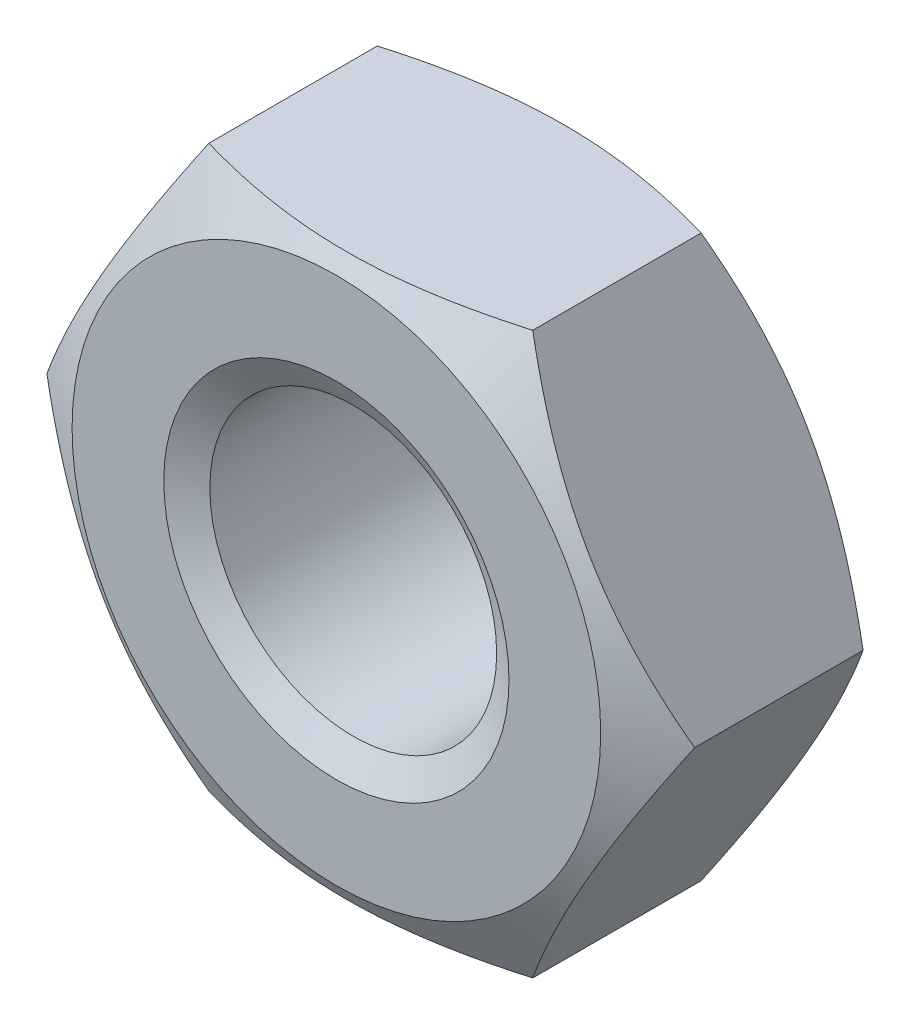
ISO-10303-21;
HEADER;
FILE_DESCRIPTION(('STEP AP214'),'2;1');
FILE_NAME('part.step','',(''),(''),'','','');
FILE_SCHEMA(('AUTOMOTIVE_DESIGN { 1 0 10303 214 1 1 1 1 }'));
ENDSEC;
DATA;
#1=APPLICATION_CONTEXT('core data for automotive mechanical design processes');
#2=APPLICATION_PROTOCOL_DEFINITION('international standard','automotive_design',2000,#1);
#3=PRODUCT_CONTEXT('',#1,'mechanical');
#4=PRODUCT('Part','Part','',(#3));
#5=PRODUCT_RELATED_PRODUCT_CATEGORY('part','',(#4));
#6=PRODUCT_DEFINITION_FORMATION('','',#4);
#7=PRODUCT_DEFINITION_CONTEXT('part definition',#1,'design');
#8=PRODUCT_DEFINITION('design','',#6,#7);
#9=PRODUCT_DEFINITION_SHAPE('','',#8);
#10=(LENGTH_UNIT() NAMED_UNIT(*) SI_UNIT(.MILLI.,.METRE.));
#11=(NAMED_UNIT(*) PLANE_ANGLE_UNIT() SI_UNIT($,.RADIAN.));
#12=(NAMED_UNIT(*) SI_UNIT($,.STERADIAN.) SOLID_ANGLE_UNIT());
#13=UNCERTAINTY_MEASURE_WITH_UNIT(LENGTH_MEASURE(1.E-05),#10,'distance_accuracy_value','');
#14=(GEOMETRIC_REPRESENTATION_CONTEXT(3) GLOBAL_UNCERTAINTY_ASSIGNED_CONTEXT((#13)) GLOBAL_UNIT_ASSIGNED_CONTEXT((#10,
#11,#12)) REPRESENTATION_CONTEXT('',''));
#15=CARTESIAN_POINT('',(0.,0.,0.));
#16=DIRECTION('',(0.,0.,1.));
#17=DIRECTION('',(1.,0.,0.));
#18=AXIS2_PLACEMENT_3D('',#15,#16,#17);
#19=CARTESIAN_POINT('',(0.,-13.,0.));
#20=DIRECTION('',(0.,0.,-1.));
#21=DIRECTION('',(-1.,0.,0.));
#22=AXIS2_PLACEMENT_3D('',#19,#20,#21);
#23=PLANE('',#22);
#24=CARTESIAN_POINT('',(0.,0.,0.));
#25=DIRECTION('',(0.,0.,-1.));
#26=DIRECTION('',(-1.,0.,0.));
#27=AXIS2_PLACEMENT_3D('',#24,#25,#26);
#28=CIRCLE('',#27,6.12499999994043);
#29=CARTESIAN_POINT('',(-6.12499999994043,0.,0.));
#30=VERTEX_POINT('',#29);
#31=EDGE_CURVE('E105',#30,#30,#28,.T.);
#32=ORIENTED_EDGE('',*,*,#31,.F.);
#33=EDGE_LOOP('',(#32));
#34=FACE_BOUND('',#33,.T.);
#35=CARTESIAN_POINT('',(0.,0.,0.));
#36=DIRECTION('',(0.,0.,1.));
#37=DIRECTION('',(1.,0.,0.));
#38=AXIS2_PLACEMENT_3D('',#35,#36,#37);
#39=CIRCLE('',#38,4.0000000000191);
#40=CARTESIAN_POINT('',(4.0000000000191,0.,0.));
#41=VERTEX_POINT('',#40);
#42=EDGE_CURVE('E20',#41,#41,#39,.F.);
#43=ORIENTED_EDGE('',*,*,#42,.T.);
#44=EDGE_LOOP('',(#43));
#45=FACE_BOUND('',#44,.T.);
#46=ADVANCED_FACE('F17',(#34,#45),#23,.F.);
#47=CARTESIAN_POINT('',(0.,0.,0.));
#48=DIRECTION('',(0.,0.,1.));
#49=DIRECTION('',(1.,0.,0.));
#50=AXIS2_PLACEMENT_3D('',#47,#48,#49);
#51=CONICAL_SURFACE('',#50,4.0000000000191,1.04719755120605);
#52=ORIENTED_EDGE('',*,*,#42,.F.);
#53=EDGE_LOOP('',(#52));
#54=FACE_BOUND('',#53,.T.);
#55=CARTESIAN_POINT('',(0.,0.,-0.39057745710678));
#56=DIRECTION('',(0.,0.,1.));
#57=DIRECTION('',(1.,0.,0.));
#58=AXIS2_PLACEMENT_3D('',#55,#56,#57);
#59=CIRCLE('',#58,3.3235);
#60=CARTESIAN_POINT('',(3.3235,0.,-0.39057745710678));
#61=VERTEX_POINT('',#60);
#62=EDGE_CURVE('E80',#61,#61,#59,.F.);
#63=ORIENTED_EDGE('',*,*,#62,.T.);
#64=EDGE_LOOP('',(#63));
#65=FACE_BOUND('',#64,.T.);
#66=ADVANCED_FACE('F157',(#54,#65),#51,.F.);
#67=CARTESIAN_POINT('',(0.,0.,-0.801845312196292));
#68=DIRECTION('',(0.,0.,-1.));
#69=DIRECTION('',(-1.,0.,0.));
#70=AXIS2_PLACEMENT_3D('',#67,#68,#69);
#71=CONICAL_SURFACE('',#70,7.5138368204648,1.04719755119331);
#72=CARTESIAN_POINT('',(7.50555349945997,-1.26746405809184E-11,-0.797062934582183));
#73=CARTESIAN_POINT('',(7.42306413225106,-0.142875775100371,-0.749446864134252));
#74=CARTESIAN_POINT('',(7.34026720584725,-0.286284258341302,-0.703991966642178));
#75=CARTESIAN_POINT('',(7.17400096467622,-0.574265835632288,-0.617999720662978));
#76=CARTESIAN_POINT('',(7.09053137628506,-0.718839403612883,-0.57746449352778));
#77=CARTESIAN_POINT('',(6.83878625276132,-1.15487474811409,-0.464034036214897));
#78=CARTESIAN_POINT('',(6.66951702603889,-1.44805764895502,-0.39951709945342));
#79=CARTESIAN_POINT('',(6.41620872846171,-1.88680049033741,-0.323865199560767));
#80=CARTESIAN_POINT('',(6.33292644226829,-2.03104964139492,-0.302314522006785));
#81=CARTESIAN_POINT('',(6.16598561363625,-2.32019963844327,-0.266178050220192));
#82=CARTESIAN_POINT('',(6.08232710510015,-2.46510042571322,-0.251591640626662));
#83=CARTESIAN_POINT('',(5.91486483881255,-2.75515357927398,-0.229755442526423));
#84=CARTESIAN_POINT('',(5.83106135446542,-2.90030547201451,-0.222497328854949));
#85=CARTESIAN_POINT('',(5.663381658914,-3.19073522410725,-0.215465561854509));
#86=CARTESIAN_POINT('',(5.57950545003741,-3.33601307942777,-0.215691677222158));
#87=CARTESIAN_POINT('',(5.34972638911367,-3.73400208746314,-0.226597904744973));
#88=CARTESIAN_POINT('',(5.20389879784426,-3.98658288468715,-0.244897374835346));
#89=CARTESIAN_POINT('',(4.913212163536,-4.49006690439025,-0.302918893745997));
#90=CARTESIAN_POINT('',(4.7683541423755,-4.74096835692412,-0.34266076347519));
#91=CARTESIAN_POINT('',(4.47708276744821,-5.24546517708864,-0.442001445728198));
#92=CARTESIAN_POINT('',(4.33070615631917,-5.49899690460388,-0.502021047428562));
#93=CARTESIAN_POINT('',(4.04013550251964,-6.00228004017317,-0.638240383200471));
#94=CARTESIAN_POINT('',(3.89593774018915,-6.25203789086733,-0.714408131324337));
#95=CARTESIAN_POINT('',(3.75277674973737,-6.49999999999169,-0.797062934584546));
#96=B_SPLINE_CURVE_WITH_KNOTS('',3,(#72,#73,#74,#75,#76,#77,#78,#79,#80,#81,#82,#83,#84,#85,#86,
#87,#88,#89,#90,#91,#92,#93,#94,#95),.UNSPECIFIED.,.F.,.F.,(4,2,2,2,2,2,2,2,2,2,2,4),(0.,
0.515097151807919,1.03041562924708,2.06319349702549,2.56693469263122,3.07063136955379,
3.57375518587219,4.0768634529426,4.95263085757274,5.82920919384532,6.72522583709603,
7.61948397792585),.UNSPECIFIED.);
#97=CARTESIAN_POINT('',(7.50555349943455,-6.01295083421546E-12,-0.797062934546425));
#98=VERTEX_POINT('',#97);
#99=CARTESIAN_POINT('',(3.75277674973527,-6.49999999999533,-0.797062934585759));
#100=VERTEX_POINT('',#99);
#101=EDGE_CURVE('E71',#98,#100,#96,.T.);
#102=ORIENTED_EDGE('',*,*,#101,.F.);
#103=CARTESIAN_POINT('',(3.75277674974378,6.49999999999553,-0.797062934579687));
#104=CARTESIAN_POINT('',(3.83526611694781,6.35712422490451,-0.74944686413392));
#105=CARTESIAN_POINT('',(3.9180630433495,6.21371574166224,-0.703991966642765));
#106=CARTESIAN_POINT('',(4.08432928451886,5.9257341643704,-0.617999720664248));
#107=CARTESIAN_POINT('',(4.16779887291045,5.78116059639029,-0.577464493528816));
#108=CARTESIAN_POINT('',(4.4195439964348,5.34512525188997,-0.464034036215522));
#109=CARTESIAN_POINT('',(4.58881322315667,5.05194235104894,-0.399517099454174));
#110=CARTESIAN_POINT('',(4.84212152073355,4.61319950966673,-0.323865199561441));
#111=CARTESIAN_POINT('',(4.92540380692696,4.46895035860932,-0.302314522007389));
#112=CARTESIAN_POINT('',(5.09234463555894,4.17980036156114,-0.266178050220664));
#113=CARTESIAN_POINT('',(5.17600314409498,4.03489957429126,-0.251591640627072));
#114=CARTESIAN_POINT('',(5.34346541038249,3.74484642073065,-0.229755442526694));
#115=CARTESIAN_POINT('',(5.42726889472957,3.5996945279902,-0.222497328855143));
#116=CARTESIAN_POINT('',(5.5949485902809,3.30926477589762,-0.215465561854542));
#117=CARTESIAN_POINT('',(5.67882479915745,3.16398692057717,-0.215691677222107));
#118=CARTESIAN_POINT('',(5.90860386008122,2.76599791254175,-0.226597904744688));
#119=CARTESIAN_POINT('',(6.05443145135071,2.5134171153176,-0.244897374834928));
#120=CARTESIAN_POINT('',(6.34511808565913,2.00993309561422,-0.302918893745348));
#121=CARTESIAN_POINT('',(6.48997610681972,1.7590316430802,-0.342660763474445));
#122=CARTESIAN_POINT('',(6.78124748174717,1.2545348229154,-0.442001445727291));
#123=CARTESIAN_POINT('',(6.92762409287628,1.00100309540004,-0.502021047427587));
#124=CARTESIAN_POINT('',(7.21819474667595,0.497719959830505,-0.638240383199387));
#125=CARTESIAN_POINT('',(7.3623925090065,0.247962109136237,-0.714408131323212));
#126=CARTESIAN_POINT('',(7.50555349945834,1.17642045864442E-11,-0.797062934583393));
#127=B_SPLINE_CURVE_WITH_KNOTS('',3,(#103,#104,#105,#106,#107,#108,#109,#110,#111,#112,#113,
#114,#115,#116,#117,#118,#119,#120,#121,#122,#123,#124,#125,#126),.UNSPECIFIED.,.F.,.F.,(4,2,2,
2,2,2,2,2,2,2,2,4),(0.,0.515097151807478,1.03041562924625,2.063193497024,2.56693469262949,
3.07063136955181,3.57375518586995,4.07686345294009,4.95263085757068,5.82920919384372,
6.72522583709482,7.61948397792498),.UNSPECIFIED.);
#128=CARTESIAN_POINT('',(3.75277674972718,6.5,-0.797062934585759));
#129=VERTEX_POINT('',#128);
#130=EDGE_CURVE('E61',#129,#98,#127,.T.);
#131=ORIENTED_EDGE('',*,*,#130,.F.);
#132=CARTESIAN_POINT('',(-3.75277674972309,6.50000000000748,-0.797062934579684));
#133=CARTESIAN_POINT('',(-3.58779801530686,6.50000000000275,-0.749446864133918));
#134=CARTESIAN_POINT('',(-3.42220416250001,6.50000000000075,-0.703991966642763));
#135=CARTESIAN_POINT('',(-3.08967168015869,6.49999999999925,-0.617999720664246));
#136=CARTESIAN_POINT('',(-2.92273250337635,6.49999999999974,-0.577464493528813));
#137=CARTESIAN_POINT('',(-2.41924225632901,6.50000000000052,-0.46403403621552));
#138=CARTESIAN_POINT('',(-2.08070380288452,6.50000000000009,-0.399517099454172));
#139=CARTESIAN_POINT('',(-1.57408720773052,6.49999999999995,-0.32386519956144));
#140=CARTESIAN_POINT('',(-1.40752263534376,6.49999999999999,-0.302314522007387));
#141=CARTESIAN_POINT('',(-1.07364097807985,6.50000000000001,-0.266178050220662));
#142=CARTESIAN_POINT('',(-0.906323961007753,6.5,-0.25159164062707));
#143=CARTESIAN_POINT('',(-0.57139942843272,6.5,-0.229755442526693));
#144=CARTESIAN_POINT('',(-0.403792459738558,6.5,-0.222497328855141));
#145=CARTESIAN_POINT('',(-0.0684330686359017,6.5,-0.21546556185454));
#146=CARTESIAN_POINT('',(0.0993193491171958,6.5,-0.215691677222106));
#147=CARTESIAN_POINT('',(0.558877470965063,6.5,-0.226597904744695));
#148=CARTESIAN_POINT('',(0.850532653504385,6.5,-0.244897374834969));
#149=CARTESIAN_POINT('',(1.4319059221219,6.5,-0.302918893745506));
#150=CARTESIAN_POINT('',(1.7216219644434,6.5,-0.342660763474685));
#151=CARTESIAN_POINT('',(2.30416471429897,6.5,-0.442001445727735));
#152=CARTESIAN_POINT('',(2.59691793655753,6.5,-0.502021047428155));
#153=CARTESIAN_POINT('',(3.17805924415753,6.5,-0.63824038320023));
#154=CARTESIAN_POINT('',(3.46645476881897,6.5,-0.714408131324206));
#155=CARTESIAN_POINT('',(3.75277674972298,6.5,-0.797062934584545));
#156=B_SPLINE_CURVE_WITH_KNOTS('',3,(#132,#133,#134,#135,#136,#137,#138,#139,#140,#141,#142,
#143,#144,#145,#146,#147,#148,#149,#150,#151,#152,#153,#154,#155),.UNSPECIFIED.,.F.,.F.,(4,2,2,
2,2,2,2,2,2,2,2,4),(0.,0.51509715180748,1.03041562924625,2.06319349702401,2.56693469262949,
3.07063136955181,3.57375518586995,4.07686345294009,4.95263085757168,5.82920919384574,
6.72522583709791,7.61948397792913),.UNSPECIFIED.);
#157=CARTESIAN_POINT('',(-3.75277674973526,6.49999999999533,-0.797062934585758));
#158=VERTEX_POINT('',#157);
#159=EDGE_CURVE('E91',#158,#129,#156,.T.);
#160=ORIENTED_EDGE('',*,*,#159,.F.);
#161=CARTESIAN_POINT('',(-7.50555349945997,1.26724419200023E-11,-0.79706293458218));
#162=CARTESIAN_POINT('',(-7.42306413225105,0.142875775100368,-0.74944686413425));
#163=CARTESIAN_POINT('',(-7.34026720584725,0.286284258341299,-0.703991966642177));
#164=CARTESIAN_POINT('',(-7.17400096467621,0.574265835632285,-0.617999720662976));
#165=CARTESIAN_POINT('',(-7.09053137628506,0.71883940361288,-0.577464493527778));
#166=CARTESIAN_POINT('',(-6.83878625276132,1.15487474811409,-0.464034036214895));
#167=CARTESIAN_POINT('',(-6.66951702603889,1.44805764895501,-0.399517099453419));
#168=CARTESIAN_POINT('',(-6.41620872846171,1.8868004903374,-0.323865199560765));
#169=CARTESIAN_POINT('',(-6.33292644226829,2.03104964139492,-0.302314522006782));
#170=CARTESIAN_POINT('',(-6.16598561363625,2.32019963844327,-0.266178050220189));
#171=CARTESIAN_POINT('',(-6.08232710510015,2.46510042571321,-0.25159164062666));
#172=CARTESIAN_POINT('',(-5.91486483881255,2.75515357927397,-0.229755442526421));
#173=CARTESIAN_POINT('',(-5.83106135446542,2.9003054720145,-0.222497328854946));
#174=CARTESIAN_POINT('',(-5.663381658914,3.19073522410724,-0.215465561854506));
#175=CARTESIAN_POINT('',(-5.57950545003741,3.33601307942776,-0.215691677222155));
#176=CARTESIAN_POINT('',(-5.34972638911367,3.73400208746313,-0.22659790474497));
#177=CARTESIAN_POINT('',(-5.20389879784426,3.98658288468715,-0.244897374835343));
#178=CARTESIAN_POINT('',(-4.913212163536,4.49006690439024,-0.302918893745994));
#179=CARTESIAN_POINT('',(-4.7683541423755,4.74096835692412,-0.342660763475187));
#180=CARTESIAN_POINT('',(-4.4770827674482,5.24546517708864,-0.442001445728195));
#181=CARTESIAN_POINT('',(-4.33070615631917,5.49899690460388,-0.50202104742856));
#182=CARTESIAN_POINT('',(-4.04013550251964,6.00228004017318,-0.63824038320047));
#183=CARTESIAN_POINT('',(-3.89593774018914,6.25203789086733,-0.714408131324337));
#184=CARTESIAN_POINT('',(-3.75277674973736,6.4999999999917,-0.797062934584547));
#185=B_SPLINE_CURVE_WITH_KNOTS('',3,(#161,#162,#163,#164,#165,#166,#167,#168,#169,#170,#171,
#172,#173,#174,#175,#176,#177,#178,#179,#180,#181,#182,#183,#184),.UNSPECIFIED.,.F.,.F.,(4,2,2,
2,2,2,2,2,2,2,2,4),(0.,0.515097151807918,1.03041562924708,2.06319349702549,2.56693469263122,
3.07063136955378,3.57375518587219,4.07686345294259,4.95263085757274,5.82920919384532,
6.72522583709604,7.61948397792586),.UNSPECIFIED.);
#186=CARTESIAN_POINT('',(-7.50555349943932,0.,-0.797062934576849));
#187=VERTEX_POINT('',#186);
#188=EDGE_CURVE('E95',#187,#158,#185,.T.);
#189=ORIENTED_EDGE('',*,*,#188,.F.);
#190=CARTESIAN_POINT('',(-3.75277674974378,-6.49999999999553,-0.797062934579687));
#191=CARTESIAN_POINT('',(-3.83526611694781,-6.35712422490451,-0.74944686413392));
#192=CARTESIAN_POINT('',(-3.9180630433495,-6.21371574166224,-0.703991966642765));
#193=CARTESIAN_POINT('',(-4.08432928451886,-5.9257341643704,-0.617999720664248));
#194=CARTESIAN_POINT('',(-4.16779887291045,-5.78116059639028,-0.577464493528815));
#195=CARTESIAN_POINT('',(-4.4195439964348,-5.34512525188997,-0.464034036215522));
#196=CARTESIAN_POINT('',(-4.58881322315667,-5.05194235104894,-0.399517099454173));
#197=CARTESIAN_POINT('',(-4.84212152073355,-4.61319950966673,-0.323865199561441));
#198=CARTESIAN_POINT('',(-4.92540380692696,-4.46895035860932,-0.302314522007389));
#199=CARTESIAN_POINT('',(-5.09234463555893,-4.17980036156114,-0.266178050220664));
#200=CARTESIAN_POINT('',(-5.17600314409498,-4.03489957429126,-0.251591640627072));
#201=CARTESIAN_POINT('',(-5.34346541038249,-3.74484642073065,-0.229755442526694));
#202=CARTESIAN_POINT('',(-5.42726889472957,-3.5996945279902,-0.222497328855143));
#203=CARTESIAN_POINT('',(-5.5949485902809,-3.30926477589762,-0.215465561854542));
#204=CARTESIAN_POINT('',(-5.67882479915745,-3.16398692057717,-0.215691677222107));
#205=CARTESIAN_POINT('',(-5.90860386008122,-2.76599791254175,-0.226597904744688));
#206=CARTESIAN_POINT('',(-6.05443145135071,-2.5134171153176,-0.244897374834928));
#207=CARTESIAN_POINT('',(-6.34511808565913,-2.00993309561422,-0.302918893745348));
#208=CARTESIAN_POINT('',(-6.48997610681972,-1.7590316430802,-0.342660763474445));
#209=CARTESIAN_POINT('',(-6.78124748174717,-1.25453482291541,-0.44200144572729));
#210=CARTESIAN_POINT('',(-6.92762409287628,-1.00100309540004,-0.502021047427587));
#211=CARTESIAN_POINT('',(-7.21819474667594,-0.497719959830508,-0.638240383199386));
#212=CARTESIAN_POINT('',(-7.3623925090065,-0.247962109136239,-0.714408131323212));
#213=CARTESIAN_POINT('',(-7.50555349945834,-1.17669440239003E-11,-0.797062934583392));
#214=B_SPLINE_CURVE_WITH_KNOTS('',3,(#190,#191,#192,#193,#194,#195,#196,#197,#198,#199,#200,
#201,#202,#203,#204,#205,#206,#207,#208,#209,#210,#211,#212,#213),.UNSPECIFIED.,.F.,.F.,(4,2,2,
2,2,2,2,2,2,2,2,4),(0.,0.515097151807478,1.03041562924625,2.063193497024,2.56693469262948,
3.07063136955181,3.57375518586995,4.07686345294009,4.95263085757067,5.82920919384372,
6.72522583709482,7.61948397792498),.UNSPECIFIED.);
#215=CARTESIAN_POINT('',(-3.75277674972718,-6.5,-0.797062934585759));
#216=VERTEX_POINT('',#215);
#217=EDGE_CURVE('E99',#216,#187,#214,.T.);
#218=ORIENTED_EDGE('',*,*,#217,.F.);
#219=CARTESIAN_POINT('',(3.7527767497231,-6.50000000000747,-0.797062934579686));
#220=CARTESIAN_POINT('',(3.58779801530687,-6.50000000000275,-0.74944686413392));
#221=CARTESIAN_POINT('',(3.42220416250002,-6.50000000000075,-0.703991966642764));
#222=CARTESIAN_POINT('',(3.0896716801587,-6.49999999999925,-0.617999720664247));
#223=CARTESIAN_POINT('',(2.92273250337636,-6.49999999999974,-0.577464493528814));
#224=CARTESIAN_POINT('',(2.41924225632902,-6.50000000000052,-0.46403403621552));
#225=CARTESIAN_POINT('',(2.08070380288453,-6.50000000000009,-0.399517099454173));
#226=CARTESIAN_POINT('',(1.57408720773053,-6.49999999999995,-0.32386519956144));
#227=CARTESIAN_POINT('',(1.40752263534377,-6.49999999999999,-0.302314522007387));
#228=CARTESIAN_POINT('',(1.07364097807986,-6.50000000000001,-0.266178050220662));
#229=CARTESIAN_POINT('',(0.90632396100776,-6.5,-0.25159164062707));
#230=CARTESIAN_POINT('',(0.571399428432728,-6.5,-0.229755442526693));
#231=CARTESIAN_POINT('',(0.403792459738565,-6.5,-0.222497328855142));
#232=CARTESIAN_POINT('',(0.0684330686359089,-6.5,-0.21546556185454));
#233=CARTESIAN_POINT('',(-0.0993193491171888,-6.5,-0.215691677222105));
#234=CARTESIAN_POINT('',(-0.558877470965056,-6.5,-0.226597904744694));
#235=CARTESIAN_POINT('',(-0.850532653504379,-6.5,-0.244897374834968));
#236=CARTESIAN_POINT('',(-1.43190592212189,-6.5,-0.302918893745506));
#237=CARTESIAN_POINT('',(-1.72162196444339,-6.5,-0.342660763474684));
#238=CARTESIAN_POINT('',(-2.30416471429897,-6.5,-0.442001445727734));
#239=CARTESIAN_POINT('',(-2.59691793655752,-6.5,-0.502021047428154));
#240=CARTESIAN_POINT('',(-3.17805924415753,-6.5,-0.638240383200229));
#241=CARTESIAN_POINT('',(-3.46645476881897,-6.5,-0.714408131324205));
#242=CARTESIAN_POINT('',(-3.75277674972298,-6.5,-0.797062934584545));
#243=B_SPLINE_CURVE_WITH_KNOTS('',3,(#219,#220,#221,#222,#223,#224,#225,#226,#227,#228,#229,
#230,#231,#232,#233,#234,#235,#236,#237,#238,#239,#240,#241,#242),.UNSPECIFIED.,.F.,.F.,(4,2,2,
2,2,2,2,2,2,2,2,4),(0.,0.515097151807481,1.03041562924625,2.06319349702401,2.56693469262949,
3.07063136955181,3.57375518586995,4.07686345294009,4.95263085757169,5.82920919384575,
6.72522583709792,7.61948397792914),.UNSPECIFIED.);
#244=EDGE_CURVE('E75',#100,#216,#243,.T.);
#245=ORIENTED_EDGE('',*,*,#244,.F.);
#246=EDGE_LOOP('',(#102,#131,#160,#189,#218,#245));
#247=FACE_BOUND('',#246,.T.);
#248=ORIENTED_EDGE('',*,*,#31,.T.);
#249=EDGE_LOOP('',(#248));
#250=FACE_BOUND('',#249,.T.);
#251=ADVANCED_FACE('F72',(#247,#250),#71,.T.);
#252=CARTESIAN_POINT('',(0.,0.,-6.8));
#253=DIRECTION('',(0.,0.,1.));
#254=DIRECTION('',(1.,0.,0.));
#255=AXIS2_PLACEMENT_3D('',#252,#253,#254);
#256=CYLINDRICAL_SURFACE('',#255,3.3235);
#257=CARTESIAN_POINT('',(0.,0.,-5.09999999997035));
#258=DIRECTION('',(0.,0.,-1.));
#259=DIRECTION('',(-1.,0.,0.));
#260=AXIS2_PLACEMENT_3D('',#257,#258,#259);
#261=CIRCLE('',#260,3.3235000000218);
#262=CARTESIAN_POINT('',(-3.3235000000218,0.,-5.09999999997035));
#263=VERTEX_POINT('',#262);
#264=EDGE_CURVE('E85',#263,#263,#261,.T.);
#265=ORIENTED_EDGE('',*,*,#264,.T.);
#266=EDGE_LOOP('',(#265));
#267=FACE_BOUND('',#266,.T.);
#268=ORIENTED_EDGE('',*,*,#62,.F.);
#269=EDGE_LOOP('',(#268));
#270=FACE_BOUND('',#269,.T.);
#271=ADVANCED_FACE('F156',(#267,#270),#256,.F.);
#272=CARTESIAN_POINT('',(3.75277674973258,-6.5,-6.8));
#273=DIRECTION('',(0.866025403784439,-0.5,0.));
#274=DIRECTION('',(0.5,0.866025403784439,0.));
#275=AXIS2_PLACEMENT_3D('',#272,#273,#274);
#276=PLANE('',#275);
#277=ORIENTED_EDGE('',*,*,#101,.T.);
#278=DIRECTION('',(0.,0.,1.));
#279=VECTOR('',#278,1.);
#280=CARTESIAN_POINT('',(3.75277674973258,-6.5,-6.8));
#281=LINE('',#280,#279);
#282=CARTESIAN_POINT('',(3.75277677137748,-6.49999996250993,-4.70000001243648));
#283=VERTEX_POINT('',#282);
#284=EDGE_CURVE('E79',#283,#100,#281,.T.);
#285=ORIENTED_EDGE('',*,*,#284,.F.);
#286=CARTESIAN_POINT('',(7.50555349943961,-4.59927503235988E-11,-4.69999999990956));
#287=CARTESIAN_POINT('',(7.42303699090516,-0.142922785289727,-4.74780718963419));
#288=CARTESIAN_POINT('',(7.34021064037411,-0.286382232614545,-4.7934451338097));
#289=CARTESIAN_POINT('',(7.17388030748702,-0.574474820014469,-4.87978381108413));
#290=CARTESIAN_POINT('',(7.0903760468018,-0.719108442169872,-4.92048239416971));
#291=CARTESIAN_POINT('',(6.83851575107887,-1.1553432707715,-5.03436935455443));
#292=CARTESIAN_POINT('',(6.66915808624861,-1.44867935090862,-5.09914319894474));
#293=CARTESIAN_POINT('',(6.41572193059373,-1.88764364897778,-5.1750751216362));
#294=CARTESIAN_POINT('',(6.33240638004381,-2.03195041559082,-5.19670009757581));
#295=CARTESIAN_POINT('',(6.16539624694976,-2.32122045148856,-5.23295346143799));
#296=CARTESIAN_POINT('',(6.08170169885143,-2.46618366111138,-5.24758247280886));
#297=CARTESIAN_POINT('',(5.91416672131715,-2.75636275424566,-5.26946983898017));
#298=CARTESIAN_POINT('',(5.8303265696832,-2.90157815658994,-5.27673663664082));
#299=CARTESIAN_POINT('',(5.66257345475982,-3.19213507476518,-5.28375134433767));
#300=CARTESIAN_POINT('',(5.57866049382923,-3.3374765865105,-5.28349948948667));
#301=CARTESIAN_POINT('',(5.34891260639935,-3.73541160047067,-5.27248255514731));
#302=CARTESIAN_POINT('',(5.20315399770455,-3.98787291637062,-5.25408410996374));
#303=CARTESIAN_POINT('',(4.91261238717601,-4.49110574751894,-5.19581136800484));
#304=CARTESIAN_POINT('',(4.76783042287445,-4.74187546570887,-5.15591704323436));
#305=CARTESIAN_POINT('',(4.47670158312332,-5.24612540770639,-5.0562190888417));
#306=CARTESIAN_POINT('',(4.330391935388,-5.49954115122147,-4.99599085196764));
#307=CARTESIAN_POINT('',(4.03996879204939,-6.0025687911778,-4.85931971681482));
#308=CARTESIAN_POINT('',(3.89585152461738,-6.25218722061804,-4.78290912956535));
#309=CARTESIAN_POINT('',(3.75277679302145,-6.49999992502148,-4.70000002497868));
#310=B_SPLINE_CURVE_WITH_KNOTS('',3,(#286,#287,#288,#289,#290,#291,#292,#293,#294,#295,#296,
#297,#298,#299,#300,#301,#302,#303,#304,#305,#306,#307,#308,#309),.UNSPECIFIED.,.F.,.F.,(4,2,2,
2,2,2,2,2,2,2,2,4),(0.,0.515412518945595,1.03104858893057,2.06448237103259,2.56844910772266,
3.07237092483326,3.57571419669567,4.07904172872666,4.9544095024563,5.83059428178326,
6.7263406391918,7.62031505857119),.UNSPECIFIED.);
#311=CARTESIAN_POINT('',(7.5055534994096,0.,-4.69999999996168));
#312=VERTEX_POINT('',#311);
#313=EDGE_CURVE('E84',#312,#283,#310,.T.);
#314=ORIENTED_EDGE('',*,*,#313,.F.);
#315=DIRECTION('',(0.,0.,1.));
#316=VECTOR('',#315,1.);
#317=CARTESIAN_POINT('',(7.50555349946514,0.,-6.8));
#318=LINE('',#317,#316);
#319=EDGE_CURVE('E35',#98,#312,#318,.F.);
#320=ORIENTED_EDGE('',*,*,#319,.F.);
#321=EDGE_LOOP('',(#277,#285,#314,#320));
#322=FACE_BOUND('',#321,.T.);
#323=ADVANCED_FACE('F83',(#322),#276,.T.);
#324=CARTESIAN_POINT('',(-3.75277674973256,-6.5,-6.8));
#325=DIRECTION('',(0.,-1.,0.));
#326=DIRECTION('',(1.,0.,0.));
#327=AXIS2_PLACEMENT_3D('',#324,#325,#326);
#328=PLANE('',#327);
#329=ORIENTED_EDGE('',*,*,#244,.T.);
#330=DIRECTION('',(0.,0.,1.));
#331=VECTOR('',#330,1.);
#332=CARTESIAN_POINT('',(-3.75277674973257,-6.5,-6.8));
#333=LINE('',#332,#331);
#334=CARTESIAN_POINT('',(-3.75277670644439,-6.5,-4.70000001243601));
#335=VERTEX_POINT('',#334);
#336=EDGE_CURVE('E100',#335,#216,#333,.T.);
#337=ORIENTED_EDGE('',*,*,#336,.F.);
#338=CARTESIAN_POINT('',(3.75277677636153,-6.49999996253879,-4.69999996768154));
#339=CARTESIAN_POINT('',(3.58774376180418,-6.49999998621388,-4.74780717247496));
#340=CARTESIAN_POINT('',(3.42209106096878,-6.49999999622857,-4.79344512342462));
#341=CARTESIAN_POINT('',(3.0894303936541,-6.50000000377306,-4.87978380660095));
#342=CARTESIAN_POINT('',(2.92242187051639,-6.50000000129746,-4.92048238881426));
#343=CARTESIAN_POINT('',(2.41870127454236,-6.49999999739963,-5.03436934857476));
#344=CARTESIAN_POINT('',(2.07998594267824,-6.49999999953161,-5.09914319528522));
#345=CARTESIAN_POINT('',(1.57311362780811,-6.50000000022842,-5.1750751196359));
#346=CARTESIAN_POINT('',(1.40648252559796,-6.5000000000612,-5.19670009582551));
#347=CARTESIAN_POINT('',(1.07246225723202,-6.4999999999388,-5.23295346023176));
#348=CARTESIAN_POINT('',(0.905073159967937,-6.49999999998359,-5.24758247189773));
#349=CARTESIAN_POINT('',(0.570003202688611,-6.50000000001639,-5.26946983853795));
#350=CARTESIAN_POINT('',(0.402322898277242,-6.50000000000447,-5.27673663637015));
#351=CARTESIAN_POINT('',(0.0668166661282161,-6.49999999999553,-5.28375134431755));
#352=CARTESIAN_POINT('',(-0.101009256891759,-6.49999999999851,-5.28349948954504));
#353=CARTESIAN_POINT('',(-0.56050503309441,-6.5000000000026,-5.27248255531847));
#354=CARTESIAN_POINT('',(-0.852022250671479,-6.5000000000007,-5.25408411020438));
#355=CARTESIAN_POINT('',(-1.43310547204756,-6.4999999999993,-5.19581136835763));
#356=CARTESIAN_POINT('',(-1.72266940078265,-6.4999999999998,-5.15591704363408));
#357=CARTESIAN_POINT('',(-2.3049270808084,-6.50000000000021,-5.05621908926672));
#358=CARTESIAN_POINT('',(-2.59754637666756,-6.5000000000001,-4.99599085235329));
#359=CARTESIAN_POINT('',(-3.17839266419266,-6.4999999999999,-4.85931971705513));
#360=CARTESIAN_POINT('',(-3.46662719951503,-6.49999999999979,-4.78290912969524));
#361=CARTESIAN_POINT('',(-3.75277666315791,-6.5,-4.70000002497779));
#362=B_SPLINE_CURVE_WITH_KNOTS('',3,(#338,#339,#340,#341,#342,#343,#344,#345,#346,#347,#348,
#349,#350,#351,#352,#353,#354,#355,#356,#357,#358,#359,#360,#361),.UNSPECIFIED.,.F.,.F.,(4,2,2,
2,2,2,2,2,2,2,2,4),(0.,0.515412523676989,1.03104859805641,2.0644823882594,2.56844912830344,
3.0723709486937,3.5757142239973,4.07904175950238,4.95440953377745,5.83059431347618,
6.72634067204767,7.62031509283759),.UNSPECIFIED.);
#363=EDGE_CURVE('E193',#283,#335,#362,.T.);
#364=ORIENTED_EDGE('',*,*,#363,.F.);
#365=ORIENTED_EDGE('',*,*,#284,.T.);
#366=EDGE_LOOP('',(#329,#337,#364,#365));
#367=FACE_BOUND('',#366,.T.);
#368=ADVANCED_FACE('F185',(#367),#328,.T.);
#369=CARTESIAN_POINT('',(-7.50555349946514,0.,-6.8));
#370=DIRECTION('',(-0.866025403784439,-0.5,0.));
#371=DIRECTION('',(0.5,-0.866025403784439,0.));
#372=AXIS2_PLACEMENT_3D('',#369,#370,#371);
#373=PLANE('',#372);
#374=ORIENTED_EDGE('',*,*,#217,.T.);
#375=DIRECTION('',(0.,0.,1.));
#376=VECTOR('',#375,1.);
#377=CARTESIAN_POINT('',(-7.50555349946514,0.,-6.8));
#378=LINE('',#377,#376);
#379=CARTESIAN_POINT('',(-7.50555349942641,0.,-4.69999999995707));
#380=VERTEX_POINT('',#379);
#381=EDGE_CURVE('E96',#380,#187,#378,.T.);
#382=ORIENTED_EDGE('',*,*,#381,.F.);
#383=CARTESIAN_POINT('',(-3.75277670397815,-6.5000000043286,-4.69999996768309));
#384=CARTESIAN_POINT('',(-3.83529323176657,-6.35707723308378,-4.74780717248016));
#385=CARTESIAN_POINT('',(-3.91811959086411,-6.21361779094972,-4.79344512343332));
#386=CARTESIAN_POINT('',(-4.08444993106929,-5.92552520596272,-4.87978380661597));
#387=CARTESIAN_POINT('',(-4.16795419050146,-5.78089158102671,-4.9204823888321));
#388=CARTESIAN_POINT('',(-4.41981448513655,-5.34465674651404,-5.03436934860022));
#389=CARTESIAN_POINT('',(-4.58917215293151,-5.05132066550562,-5.09914319531358));
#390=CARTESIAN_POINT('',(-4.84260831097949,-4.61235636468505,-5.1750751196594));
#391=CARTESIAN_POINT('',(-4.92592386193245,-4.4680495970395,-5.19670009584481));
#392=CARTESIAN_POINT('',(-5.0929339959947,-4.17877955922,-5.23295346024381));
#393=CARTESIAN_POINT('',(-5.17662854465812,-4.03381634870798,-5.24758247190674));
#394=CARTESIAN_POINT('',(-5.3441635233105,-3.7436372537027,-5.2694698385419));
#395=CARTESIAN_POINT('',(-5.42800367549758,-3.59842185037654,-5.27673663637216));
#396=CARTESIAN_POINT('',(-5.59575679154784,-3.30786493023159,-5.28375134431765));
#397=CARTESIAN_POINT('',(-5.67966975305219,-3.16252341749845,-5.28349948954516));
#398=CARTESIAN_POINT('',(-5.90941764480213,-2.76458839606389,-5.27248255514233));
#399=CARTESIAN_POINT('',(-6.05517625723745,-2.51212707368138,-5.25408410927836));
#400=CARTESIAN_POINT('',(-6.34571787515919,-2.00889422972486,-5.19581136490171));
#401=CARTESIAN_POINT('',(-6.4904998431135,-1.75812450520919,-5.15591703839568));
#402=CARTESIAN_POINT('',(-6.78162869038322,-1.2538745501899,-5.05621907958446));
#403=CARTESIAN_POINT('',(-6.92793834197926,-1.00045879998765,-4.99599083997729));
#404=CARTESIAN_POINT('',(-7.21836149294048,-0.497431146828147,-4.85931969870662));
#405=CARTESIAN_POINT('',(-7.36247876413436,-0.247812710871959,-4.78290910807156));
#406=CARTESIAN_POINT('',(-7.50555349943884,-4.55567710809223E-11,-4.69999999990898));
#407=B_SPLINE_CURVE_WITH_KNOTS('',3,(#383,#384,#385,#386,#387,#388,#389,#390,#391,#392,#393,
#394,#395,#396,#397,#398,#399,#400,#401,#402,#403,#404,#405,#406),.UNSPECIFIED.,.F.,.F.,(4,2,2,
2,2,2,2,2,2,2,2,4),(0.,0.51541252372083,1.03104859814418,2.06448238844628,2.56844912844525,
3.07237094879053,3.57571422404399,4.07904175950088,4.95440955569391,5.83059435739228,
6.72634073911342,7.62031518287544),.UNSPECIFIED.);
#408=EDGE_CURVE('E200',#335,#380,#407,.T.);
#409=ORIENTED_EDGE('',*,*,#408,.F.);
#410=ORIENTED_EDGE('',*,*,#336,.T.);
#411=EDGE_LOOP('',(#374,#382,#409,#410));
#412=FACE_BOUND('',#411,.T.);
#413=ADVANCED_FACE('F189',(#412),#373,.T.);
#414=CARTESIAN_POINT('',(-3.75277674973257,6.5,-6.8));
#415=DIRECTION('',(-0.866025403784439,0.5,0.));
#416=DIRECTION('',(-0.5,-0.866025403784439,0.));
#417=AXIS2_PLACEMENT_3D('',#414,#415,#416);
#418=PLANE('',#417);
#419=ORIENTED_EDGE('',*,*,#188,.T.);
#420=DIRECTION('',(0.,0.,1.));
#421=VECTOR('',#420,1.);
#422=CARTESIAN_POINT('',(-3.75277674973257,6.5,-6.8));
#423=LINE('',#422,#421);
#424=CARTESIAN_POINT('',(-3.75277677136604,6.49999996252973,-4.70000001242986));
#425=VERTEX_POINT('',#424);
#426=EDGE_CURVE('E92',#425,#158,#423,.T.);
#427=ORIENTED_EDGE('',*,*,#426,.F.);
#428=CARTESIAN_POINT('',(-7.50555349943961,4.5991713707232E-11,-4.69999999990956));
#429=CARTESIAN_POINT('',(-7.42303699090516,0.142922785289732,-4.74780718963419));
#430=CARTESIAN_POINT('',(-7.3402106403741,0.286382232614555,-4.79344513380971));
#431=CARTESIAN_POINT('',(-7.173880307487,0.574474820014493,-4.87978381108414));
#432=CARTESIAN_POINT('',(-7.09037604680178,0.719108442169902,-4.92048239416972));
#433=CARTESIAN_POINT('',(-6.83851575107883,1.15534327077155,-5.03436935455445));
#434=CARTESIAN_POINT('',(-6.66915808624857,1.44867935090868,-5.09914319894475));
#435=CARTESIAN_POINT('',(-6.41572193059368,1.88764364897785,-5.17507512163621));
#436=CARTESIAN_POINT('',(-6.33240638004376,2.03195041559089,-5.19670009757582));
#437=CARTESIAN_POINT('',(-6.16539624694972,2.32122045148861,-5.232953461438));
#438=CARTESIAN_POINT('',(-6.0817016988514,2.46618366111143,-5.24758247280887));
#439=CARTESIAN_POINT('',(-5.91416672131713,2.75636275424569,-5.26946983898017));
#440=CARTESIAN_POINT('',(-5.83032656968319,2.90157815658996,-5.27673663664082));
#441=CARTESIAN_POINT('',(-5.66257345475981,3.19213507476519,-5.28375134433767));
#442=CARTESIAN_POINT('',(-5.57866049382922,3.33747658651051,-5.28349948948667));
#443=CARTESIAN_POINT('',(-5.34891260639749,3.73541160047388,-5.27248255514722));
#444=CARTESIAN_POINT('',(-5.20315399770084,3.98787291637702,-5.25408410996328));
#445=CARTESIAN_POINT('',(-4.91261238716863,4.4911057475317,-5.19581136800309));
#446=CARTESIAN_POINT('',(-4.76783042286525,4.74187546572478,-5.15591704323171));
#447=CARTESIAN_POINT('',(-4.47670158311045,5.24612540772867,-5.05621908883679));
#448=CARTESIAN_POINT('',(-4.33039193537327,5.49954115124697,-4.99599085196137));
#449=CARTESIAN_POINT('',(-4.03996879203102,6.00256879120962,-4.85931971680552));
#450=CARTESIAN_POINT('',(-3.89585152459721,6.25218722065296,-4.78290912955439));
#451=CARTESIAN_POINT('',(-3.75277679299951,6.49999992505946,-4.70000002496597));
#452=B_SPLINE_CURVE_WITH_KNOTS('',3,(#428,#429,#430,#431,#432,#433,#434,#435,#436,#437,#438,
#439,#440,#441,#442,#443,#444,#445,#446,#447,#448,#449,#450,#451),.UNSPECIFIED.,.F.,.F.,(4,2,2,
2,2,2,2,2,2,2,2,4),(0.,0.515412518945617,1.03104858893061,2.06448237103269,2.56844910772273,
3.07237092483331,3.57571419669569,4.07904172872666,4.9544095024674,5.83059428180552,
6.7263406392258,7.62031505861683),.UNSPECIFIED.);
#453=EDGE_CURVE('E206',#380,#425,#452,.T.);
#454=ORIENTED_EDGE('',*,*,#453,.F.);
#455=ORIENTED_EDGE('',*,*,#381,.T.);
#456=EDGE_LOOP('',(#419,#427,#454,#455));
#457=FACE_BOUND('',#456,.T.);
#458=ADVANCED_FACE('F212',(#457),#418,.T.);
#459=CARTESIAN_POINT('',(3.75277674973256,6.5,-6.8));
#460=DIRECTION('',(0.,1.,0.));
#461=DIRECTION('',(0.,0.,1.));
#462=AXIS2_PLACEMENT_3D('',#459,#460,#461);
#463=PLANE('',#462);
#464=ORIENTED_EDGE('',*,*,#159,.T.);
#465=DIRECTION('',(0.,0.,1.));
#466=VECTOR('',#465,1.);
#467=CARTESIAN_POINT('',(3.75277674973257,6.5,-6.8));
#468=LINE('',#467,#466);
#469=CARTESIAN_POINT('',(3.75277670644471,6.5,-4.70000001243592));
#470=VERTEX_POINT('',#469);
#471=EDGE_CURVE('E65',#470,#129,#468,.T.);
#472=ORIENTED_EDGE('',*,*,#471,.F.);
#473=CARTESIAN_POINT('',(-3.75277677637426,6.49999996256364,-4.69999996769411));
#474=CARTESIAN_POINT('',(-3.587743761815,6.49999998622303,-4.74780717247789));
#475=CARTESIAN_POINT('',(-3.42209106097919,6.49999999623107,-4.79344512342343));
#476=CARTESIAN_POINT('',(-3.08943039366503,6.50000000377056,-4.87978380659661));
#477=CARTESIAN_POINT('',(-2.92242187052823,6.5000000012966,-4.92048238881088));
#478=CARTESIAN_POINT('',(-2.4187012745564,6.49999999740136,-5.03436934857299));
#479=CARTESIAN_POINT('',(-2.07998594269318,6.49999999953192,-5.09914319528274));
#480=CARTESIAN_POINT('',(-1.57311362782457,6.50000000022826,-5.17507511963355));
#481=CARTESIAN_POINT('',(-1.40648252561489,6.50000000006116,-5.1967000958234));
#482=CARTESIAN_POINT('',(-1.07246225724984,6.49999999993884,-5.2329534602301));
#483=CARTESIAN_POINT('',(-0.905073159986179,6.4999999999836,-5.24758247189627));
#484=CARTESIAN_POINT('',(-0.570003202707735,6.50000000001638,-5.26946983853697));
#485=CARTESIAN_POINT('',(-0.402322898296824,6.50000000000447,-5.27673663636944));
#486=CARTESIAN_POINT('',(-0.0668166661487098,6.49999999999553,-5.28375134431742));
#487=CARTESIAN_POINT('',(0.101009256870814,6.49999999999851,-5.28349948954523));
#488=CARTESIAN_POINT('',(0.560505033074886,6.5000000000026,-5.27248255531949));
#489=CARTESIAN_POINT('',(0.852022250653839,6.5000000000007,-5.25408411020576));
#490=CARTESIAN_POINT('',(1.43310547203373,6.4999999999993,-5.19581136835941));
#491=CARTESIAN_POINT('',(1.72266940077075,6.4999999999998,-5.1559170436359));
#492=CARTESIAN_POINT('',(2.30492708080025,6.50000000000021,-5.05621908926834));
#493=CARTESIAN_POINT('',(2.59754637666123,6.5000000000001,-4.99599085235469));
#494=CARTESIAN_POINT('',(3.17839266418988,6.4999999999999,-4.85931971705587));
#495=CARTESIAN_POINT('',(3.46662719951396,6.49999999999979,-4.78290912969557));
#496=CARTESIAN_POINT('',(3.75277666315853,6.5,-4.70000002497761));
#497=B_SPLINE_CURVE_WITH_KNOTS('',3,(#473,#474,#475,#476,#477,#478,#479,#480,#481,#482,#483,
#484,#485,#486,#487,#488,#489,#490,#491,#492,#493,#494,#495,#496),.UNSPECIFIED.,.F.,.F.,(4,2,2,
2,2,2,2,2,2,2,2,4),(0.,0.515412523674876,1.03104859805241,2.06448238825213,2.56844912829491,
3.07237094868395,3.57571422398621,4.07904175948993,4.95440953377056,5.83059431347498,
6.72634067205196,7.62031509284717),.UNSPECIFIED.);
#498=EDGE_CURVE('E117',#425,#470,#497,.T.);
#499=ORIENTED_EDGE('',*,*,#498,.F.);
#500=ORIENTED_EDGE('',*,*,#426,.T.);
#501=EDGE_LOOP('',(#464,#472,#499,#500));
#502=FACE_BOUND('',#501,.T.);
#503=ADVANCED_FACE('F131',(#502),#463,.T.);
#504=CARTESIAN_POINT('',(7.50555349946514,0.,-6.8));
#505=DIRECTION('',(0.866025403784439,0.5,0.));
#506=DIRECTION('',(-0.5,0.866025403784439,0.));
#507=AXIS2_PLACEMENT_3D('',#504,#505,#506);
#508=PLANE('',#507);
#509=ORIENTED_EDGE('',*,*,#130,.T.);
#510=ORIENTED_EDGE('',*,*,#319,.T.);
#511=CARTESIAN_POINT('',(3.75277670397863,6.50000000432817,-4.69999996768341));
#512=CARTESIAN_POINT('',(3.83529323176695,6.35707723308328,-4.74780717248038));
#513=CARTESIAN_POINT('',(3.91811959086444,6.2136177909492,-4.7934451234335));
#514=CARTESIAN_POINT('',(4.08444993106958,5.92552520596219,-4.87978380661611));
#515=CARTESIAN_POINT('',(4.16795419050175,5.7808915810262,-4.92048238883223));
#516=CARTESIAN_POINT('',(4.41981448513684,5.34465674651356,-5.03436934860034));
#517=CARTESIAN_POINT('',(4.58917215293178,5.05132066550516,-5.09914319531367));
#518=CARTESIAN_POINT('',(4.84260831097973,4.61235636468462,-5.17507511965947));
#519=CARTESIAN_POINT('',(4.9259238619327,4.46804959703908,-5.19670009584487));
#520=CARTESIAN_POINT('',(5.09293399599494,4.17877955921959,-5.23295346024386));
#521=CARTESIAN_POINT('',(5.17662854465835,4.03381634870759,-5.24758247190677));
#522=CARTESIAN_POINT('',(5.34416352331072,3.74363725370232,-5.26946983854192));
#523=CARTESIAN_POINT('',(5.42800367549779,3.59842185037616,-5.27673663637217));
#524=CARTESIAN_POINT('',(5.59575679154805,3.30786493023124,-5.28375134431765));
#525=CARTESIAN_POINT('',(5.67966975305239,3.1625234174981,-5.28349948954516));
#526=CARTESIAN_POINT('',(5.90941764480231,2.76458839606359,-5.27248255514231));
#527=CARTESIAN_POINT('',(6.05517625723761,2.5121270736811,-5.25408410927833));
#528=CARTESIAN_POINT('',(6.34571787515932,2.00889422972464,-5.19581136490168));
#529=CARTESIAN_POINT('',(6.49049984311362,1.75812450520899,-5.15591703839565));
#530=CARTESIAN_POINT('',(6.7816286903833,1.25387455018975,-5.05621907958443));
#531=CARTESIAN_POINT('',(6.92793834197932,1.00045879998753,-4.99599083997726));
#532=CARTESIAN_POINT('',(7.21836149294052,0.497431146828091,-4.85931969870661));
#533=CARTESIAN_POINT('',(7.36247876413438,0.247812710871931,-4.78290910807156));
#534=CARTESIAN_POINT('',(7.50555349943884,4.55568672325906E-11,-4.69999999990898));
#535=B_SPLINE_CURVE_WITH_KNOTS('',3,(#511,#512,#513,#514,#515,#516,#517,#518,#519,#520,#521,
#522,#523,#524,#525,#526,#527,#528,#529,#530,#531,#532,#533,#534),.UNSPECIFIED.,.F.,.F.,(4,2,2,
2,2,2,2,2,2,2,2,4),(0.,0.515412523720787,1.0310485981441,2.06448238844612,2.56844912844506,
3.07237094879031,3.57571422404373,4.07904175950059,4.95440955569353,5.8305943573918,
6.72634073911285,7.62031518287477),.UNSPECIFIED.);
#536=EDGE_CURVE('E109',#470,#312,#535,.T.);
#537=ORIENTED_EDGE('',*,*,#536,.F.);
#538=ORIENTED_EDGE('',*,*,#471,.T.);
#539=EDGE_LOOP('',(#509,#510,#537,#538));
#540=FACE_BOUND('',#539,.T.);
#541=ADVANCED_FACE('F63',(#540),#508,.T.);
#542=CARTESIAN_POINT('',(0.,0.,-5.49999999998363));
#543=DIRECTION('',(0.,0.,-1.));
#544=DIRECTION('',(-1.,0.,0.));
#545=AXIS2_PLACEMENT_3D('',#542,#543,#544);
#546=CONICAL_SURFACE('',#545,3.72349999997823,0.785398163397448);
#547=CARTESIAN_POINT('',(0.,0.,-5.49999999998363));
#548=DIRECTION('',(0.,0.,-1.));
#549=DIRECTION('',(-1.,0.,0.));
#550=AXIS2_PLACEMENT_3D('',#547,#548,#549);
#551=CIRCLE('',#550,3.72349999997823);
#552=CARTESIAN_POINT('',(-3.72349999997823,0.,-5.49999999998363));
#553=VERTEX_POINT('',#552);
#554=EDGE_CURVE('E26',#553,#553,#551,.T.);
#555=ORIENTED_EDGE('',*,*,#554,.T.);
#556=EDGE_LOOP('',(#555));
#557=FACE_BOUND('',#556,.T.);
#558=ORIENTED_EDGE('',*,*,#264,.F.);
#559=EDGE_LOOP('',(#558));
#560=FACE_BOUND('',#559,.T.);
#561=ADVANCED_FACE('F130',(#557,#560),#546,.F.);
#562=CARTESIAN_POINT('',(0.,0.,-4.69519999995782));
#563=DIRECTION('',(0.,0.,1.));
#564=DIRECTION('',(1.,0.,0.));
#565=AXIS2_PLACEMENT_3D('',#562,#563,#564);
#566=CONICAL_SURFACE('',#565,7.51383682035112,1.04560342981031);
#567=ORIENTED_EDGE('',*,*,#408,.T.);
#568=ORIENTED_EDGE('',*,*,#453,.T.);
#569=ORIENTED_EDGE('',*,*,#498,.T.);
#570=ORIENTED_EDGE('',*,*,#536,.T.);
#571=ORIENTED_EDGE('',*,*,#313,.T.);
#572=ORIENTED_EDGE('',*,*,#363,.T.);
#573=EDGE_LOOP('',(#567,#568,#569,#570,#571,#572));
#574=FACE_BOUND('',#573,.T.);
#575=CARTESIAN_POINT('',(0.,0.,-5.49999999991775));
#576=DIRECTION('',(0.,0.,1.));
#577=DIRECTION('',(1.,0.,0.));
#578=AXIS2_PLACEMENT_3D('',#575,#576,#577);
#579=CIRCLE('',#578,6.12499999999727);
#580=CARTESIAN_POINT('',(6.12499999999727,0.,-5.49999999991775));
#581=VERTEX_POINT('',#580);
#582=EDGE_CURVE('E11',#581,#581,#579,.T.);
#583=ORIENTED_EDGE('',*,*,#582,.T.);
#584=EDGE_LOOP('',(#583));
#585=FACE_BOUND('',#584,.T.);
#586=ADVANCED_FACE('F124',(#574,#585),#566,.T.);
#587=CARTESIAN_POINT('',(-12.1965244366308,1.625,-5.5));
#588=DIRECTION('',(0.,0.,1.));
#589=DIRECTION('',(0.,-1.,0.));
#590=AXIS2_PLACEMENT_3D('',#587,#588,#589);
#591=PLANE('',#590);
#592=ORIENTED_EDGE('',*,*,#582,.F.);
#593=EDGE_LOOP('',(#592));
#594=FACE_BOUND('',#593,.T.);
#595=ORIENTED_EDGE('',*,*,#554,.F.);
#596=EDGE_LOOP('',(#595));
#597=FACE_BOUND('',#596,.T.);
#598=ADVANCED_FACE('F224',(#594,#597),#591,.F.);
#599=CLOSED_SHELL('',(#46,#66,#251,#271,#323,#368,#413,#458,#503,#541,#561,#586,#598));
#600=MANIFOLD_SOLID_BREP('B1',#599);
#601=ADVANCED_BREP_SHAPE_REPRESENTATION('',(#18,#600),#14);
#602=SHAPE_DEFINITION_REPRESENTATION(#9,#601);
ENDSEC;
END-ISO-10303-21;
